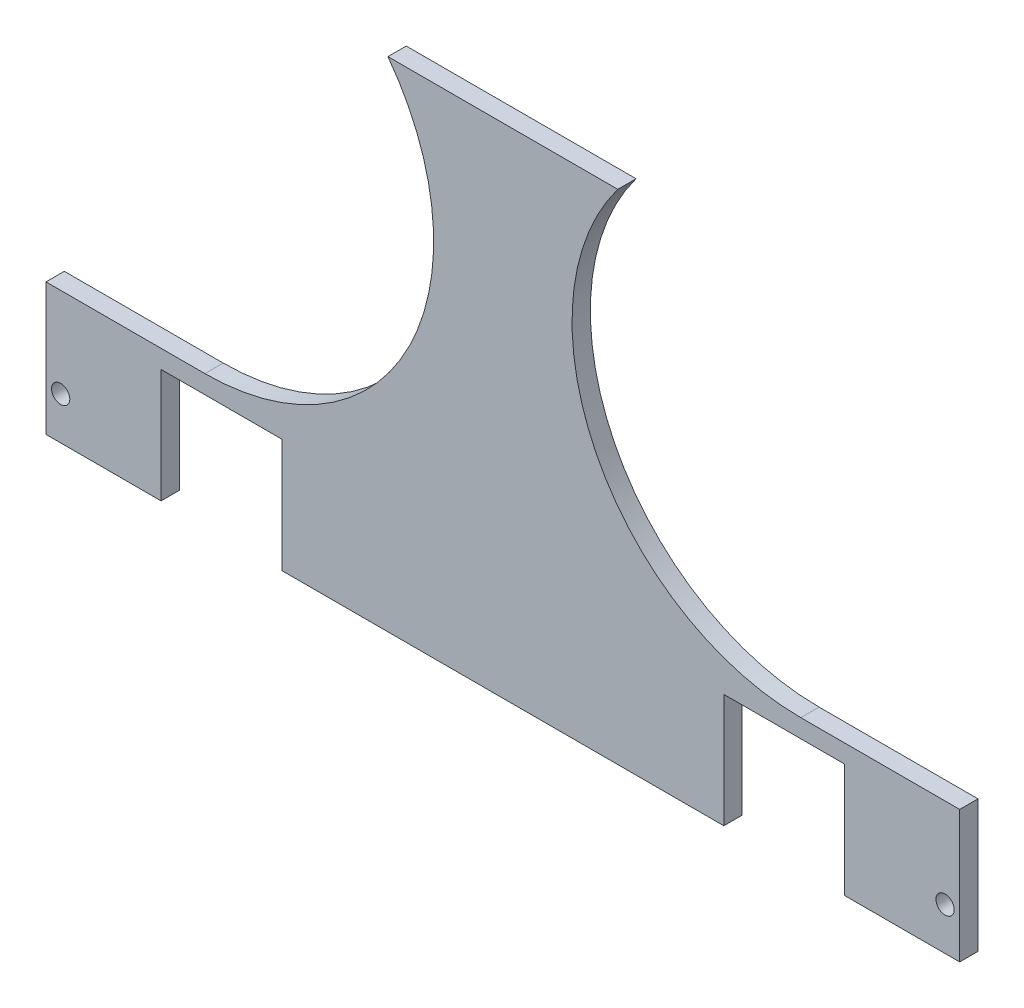
ISO-10303-21;
HEADER;
FILE_DESCRIPTION(('STEP AP214'),'2;1');
FILE_NAME('part.step','',(''),(''),'','','');
FILE_SCHEMA(('AUTOMOTIVE_DESIGN { 1 0 10303 214 1 1 1 1 }'));
ENDSEC;
DATA;
#1=APPLICATION_CONTEXT('core data for automotive mechanical design processes');
#2=APPLICATION_PROTOCOL_DEFINITION('international standard','automotive_design',2000,#1);
#3=PRODUCT_CONTEXT('',#1,'mechanical');
#4=PRODUCT('Part','Part','',(#3));
#5=PRODUCT_RELATED_PRODUCT_CATEGORY('part','',(#4));
#6=PRODUCT_DEFINITION_FORMATION('','',#4);
#7=PRODUCT_DEFINITION_CONTEXT('part definition',#1,'design');
#8=PRODUCT_DEFINITION('design','',#6,#7);
#9=PRODUCT_DEFINITION_SHAPE('','',#8);
#10=(LENGTH_UNIT() NAMED_UNIT(*) SI_UNIT(.MILLI.,.METRE.));
#11=(NAMED_UNIT(*) PLANE_ANGLE_UNIT() SI_UNIT($,.RADIAN.));
#12=(NAMED_UNIT(*) SI_UNIT($,.STERADIAN.) SOLID_ANGLE_UNIT());
#13=UNCERTAINTY_MEASURE_WITH_UNIT(LENGTH_MEASURE(1.E-05),#10,'distance_accuracy_value','');
#14=(GEOMETRIC_REPRESENTATION_CONTEXT(3) GLOBAL_UNCERTAINTY_ASSIGNED_CONTEXT((#13)) GLOBAL_UNIT_ASSIGNED_CONTEXT((#10,
#11,#12)) REPRESENTATION_CONTEXT('',''));
#15=CARTESIAN_POINT('',(0.,0.,0.));
#16=DIRECTION('',(0.,0.,1.));
#17=DIRECTION('',(1.,0.,0.));
#18=AXIS2_PLACEMENT_3D('',#15,#16,#17);
#19=CARTESIAN_POINT('',(0.,0.,5.));
#20=DIRECTION('',(0.,0.,1.));
#21=DIRECTION('',(1.,0.,0.));
#22=AXIS2_PLACEMENT_3D('',#19,#20,#21);
#23=PLANE('',#22);
#24=DIRECTION('',(-1.,0.,0.));
#25=VECTOR('',#24,1.);
#26=CARTESIAN_POINT('',(0.,-205.095411396092,5.));
#27=LINE('',#26,#25);
#28=CARTESIAN_POINT('',(249.600000000001,-205.095411396092,5.));
#29=VERTEX_POINT('',#28);
#30=CARTESIAN_POINT('',(218.160000000001,-205.095411396092,5.));
#31=VERTEX_POINT('',#30);
#32=EDGE_CURVE('E288',#29,#31,#27,.T.);
#33=ORIENTED_EDGE('',*,*,#32,.F.);
#34=DIRECTION('',(0.,1.,0.));
#35=VECTOR('',#34,1.);
#36=CARTESIAN_POINT('',(249.600000000001,-69.0000000000026,5.));
#37=LINE('',#36,#35);
#38=CARTESIAN_POINT('',(249.600000000001,-169.000000000002,5.));
#39=VERTEX_POINT('',#38);
#40=EDGE_CURVE('E164',#29,#39,#37,.T.);
#41=ORIENTED_EDGE('',*,*,#40,.T.);
#42=DIRECTION('',(1.,0.,0.));
#43=VECTOR('',#42,1.);
#44=CARTESIAN_POINT('',(206.197139998898,-169.000000000002,5.));
#45=LINE('',#44,#43);
#46=CARTESIAN_POINT('',(206.197139998898,-169.000000000002,5.));
#47=VERTEX_POINT('',#46);
#48=EDGE_CURVE('E211',#47,#39,#45,.T.);
#49=ORIENTED_EDGE('',*,*,#48,.F.);
#50=CARTESIAN_POINT('',(206.197139998898,-106.500000000002,5.));
#51=DIRECTION('',(0.,0.,1.));
#52=DIRECTION('',(1.,0.,0.));
#53=AXIS2_PLACEMENT_3D('',#50,#51,#52);
#54=CIRCLE('',#53,62.5);
#55=CARTESIAN_POINT('',(156.197139998898,-69.0000000000026,5.));
#56=VERTEX_POINT('',#55);
#57=EDGE_CURVE('E214',#56,#47,#54,.T.);
#58=ORIENTED_EDGE('',*,*,#57,.F.);
#59=DIRECTION('',(-1.,0.,0.));
#60=VECTOR('',#59,1.);
#61=CARTESIAN_POINT('',(8.39606162372775E-13,-69.0000000000026,5.));
#62=LINE('',#61,#60);
#63=CARTESIAN_POINT('',(93.4028600011043,-69.0000000000026,5.));
#64=VERTEX_POINT('',#63);
#65=EDGE_CURVE('E183',#56,#64,#62,.T.);
#66=ORIENTED_EDGE('',*,*,#65,.T.);
#67=CARTESIAN_POINT('',(43.4028600011041,-106.500000000002,5.));
#68=DIRECTION('',(0.,0.,1.));
#69=DIRECTION('',(1.,0.,0.));
#70=AXIS2_PLACEMENT_3D('',#67,#68,#69);
#71=CIRCLE('',#70,62.5);
#72=CARTESIAN_POINT('',(43.4028600011041,-169.000000000002,5.));
#73=VERTEX_POINT('',#72);
#74=EDGE_CURVE('E48',#73,#64,#71,.T.);
#75=ORIENTED_EDGE('',*,*,#74,.F.);
#76=DIRECTION('',(1.,0.,0.));
#77=VECTOR('',#76,1.);
#78=CARTESIAN_POINT('',(43.4028600011041,-169.000000000002,5.));
#79=LINE('',#78,#77);
#80=CARTESIAN_POINT('',(9.43689570931383E-13,-169.000000000002,5.));
#81=VERTEX_POINT('',#80);
#82=EDGE_CURVE('E196',#81,#73,#79,.T.);
#83=ORIENTED_EDGE('',*,*,#82,.F.);
#84=DIRECTION('',(0.,-1.,0.));
#85=VECTOR('',#84,1.);
#86=CARTESIAN_POINT('',(8.39606162372775E-13,-69.0000000000026,5.));
#87=LINE('',#86,#85);
#88=CARTESIAN_POINT('',(0.,-205.095411396092,5.));
#89=VERTEX_POINT('',#88);
#90=EDGE_CURVE('E175',#81,#89,#87,.T.);
#91=ORIENTED_EDGE('',*,*,#90,.T.);
#92=CARTESIAN_POINT('',(31.440000000001,-205.095411396092,5.));
#93=VERTEX_POINT('',#92);
#94=EDGE_CURVE('E208',#93,#89,#27,.T.);
#95=ORIENTED_EDGE('',*,*,#94,.F.);
#96=DIRECTION('',(0.,-1.,0.));
#97=VECTOR('',#96,1.);
#98=CARTESIAN_POINT('',(31.440000000001,-174.000000000003,5.));
#99=LINE('',#98,#97);
#100=CARTESIAN_POINT('',(31.440000000001,-174.000000000003,5.));
#101=VERTEX_POINT('',#100);
#102=EDGE_CURVE('E228',#101,#93,#99,.T.);
#103=ORIENTED_EDGE('',*,*,#102,.F.);
#104=DIRECTION('',(-1.,0.,0.));
#105=VECTOR('',#104,1.);
#106=CARTESIAN_POINT('',(64.4400000000009,-174.000000000003,5.));
#107=LINE('',#106,#105);
#108=CARTESIAN_POINT('',(64.4400000000009,-174.000000000003,5.));
#109=VERTEX_POINT('',#108);
#110=EDGE_CURVE('E226',#109,#101,#107,.T.);
#111=ORIENTED_EDGE('',*,*,#110,.F.);
#112=DIRECTION('',(0.,1.,0.));
#113=VECTOR('',#112,1.);
#114=CARTESIAN_POINT('',(64.4400000000009,-174.000000000003,5.));
#115=LINE('',#114,#113);
#116=CARTESIAN_POINT('',(64.4400000000009,-205.095411396092,5.));
#117=VERTEX_POINT('',#116);
#118=EDGE_CURVE('E232',#117,#109,#115,.T.);
#119=ORIENTED_EDGE('',*,*,#118,.F.);
#120=CARTESIAN_POINT('',(185.160000000001,-205.095411396092,5.));
#121=VERTEX_POINT('',#120);
#122=EDGE_CURVE('E290',#121,#117,#27,.T.);
#123=ORIENTED_EDGE('',*,*,#122,.F.);
#124=DIRECTION('',(0.,-1.,0.));
#125=VECTOR('',#124,1.);
#126=CARTESIAN_POINT('',(185.160000000001,-174.000000000003,5.));
#127=LINE('',#126,#125);
#128=CARTESIAN_POINT('',(185.160000000001,-174.000000000003,5.));
#129=VERTEX_POINT('',#128);
#130=EDGE_CURVE('E259',#129,#121,#127,.T.);
#131=ORIENTED_EDGE('',*,*,#130,.F.);
#132=DIRECTION('',(-1.,0.,0.));
#133=VECTOR('',#132,1.);
#134=CARTESIAN_POINT('',(185.160000000001,-174.000000000003,5.));
#135=LINE('',#134,#133);
#136=CARTESIAN_POINT('',(218.160000000001,-174.000000000003,5.));
#137=VERTEX_POINT('',#136);
#138=EDGE_CURVE('E265',#137,#129,#135,.T.);
#139=ORIENTED_EDGE('',*,*,#138,.F.);
#140=DIRECTION('',(0.,1.,0.));
#141=VECTOR('',#140,1.);
#142=CARTESIAN_POINT('',(218.160000000001,-174.000000000003,5.));
#143=LINE('',#142,#141);
#144=EDGE_CURVE('E262',#31,#137,#143,.T.);
#145=ORIENTED_EDGE('',*,*,#144,.F.);
#146=EDGE_LOOP('',(#33,#41,#49,#58,#66,#75,#83,#91,#95,#103,#111,#119,#123,#131,#139,#145));
#147=FACE_BOUND('',#146,.T.);
#148=CARTESIAN_POINT('',(245.600000000001,-193.500000000003,5.));
#149=DIRECTION('',(0.,0.,1.));
#150=DIRECTION('',(1.,0.,0.));
#151=AXIS2_PLACEMENT_3D('',#148,#149,#150);
#152=CIRCLE('',#151,2.50000000000002);
#153=CARTESIAN_POINT('',(248.100000000001,-193.500000000003,5.));
#154=VERTEX_POINT('',#153);
#155=EDGE_CURVE('E253',#154,#154,#152,.T.);
#156=ORIENTED_EDGE('',*,*,#155,.F.);
#157=EDGE_LOOP('',(#156));
#158=FACE_BOUND('',#157,.T.);
#159=CARTESIAN_POINT('',(4.00000000000093,-193.500000000003,5.));
#160=DIRECTION('',(0.,0.,1.));
#161=DIRECTION('',(-1.,0.,0.));
#162=AXIS2_PLACEMENT_3D('',#159,#160,#161);
#163=CIRCLE('',#162,2.50000000000002);
#164=CARTESIAN_POINT('',(1.50000000000091,-193.500000000003,5.));
#165=VERTEX_POINT('',#164);
#166=EDGE_CURVE('E247',#165,#165,#163,.T.);
#167=ORIENTED_EDGE('',*,*,#166,.F.);
#168=EDGE_LOOP('',(#167));
#169=FACE_BOUND('',#168,.T.);
#170=ADVANCED_FACE('F33',(#147,#158,#169),#23,.T.);
#171=CARTESIAN_POINT('',(0.,0.,0.));
#172=DIRECTION('',(0.,0.,1.));
#173=DIRECTION('',(1.,0.,0.));
#174=AXIS2_PLACEMENT_3D('',#171,#172,#173);
#175=PLANE('',#174);
#176=CARTESIAN_POINT('',(4.00000000000093,-193.500000000003,0.));
#177=DIRECTION('',(0.,0.,1.));
#178=DIRECTION('',(-1.,0.,0.));
#179=AXIS2_PLACEMENT_3D('',#176,#177,#178);
#180=CIRCLE('',#179,2.50000000000002);
#181=CARTESIAN_POINT('',(1.50000000000091,-193.500000000003,0.));
#182=VERTEX_POINT('',#181);
#183=EDGE_CURVE('E246',#182,#182,#180,.T.);
#184=ORIENTED_EDGE('',*,*,#183,.T.);
#185=EDGE_LOOP('',(#184));
#186=FACE_BOUND('',#185,.T.);
#187=CARTESIAN_POINT('',(245.600000000001,-193.500000000003,0.));
#188=DIRECTION('',(0.,0.,1.));
#189=DIRECTION('',(1.,0.,0.));
#190=AXIS2_PLACEMENT_3D('',#187,#188,#189);
#191=CIRCLE('',#190,2.50000000000002);
#192=CARTESIAN_POINT('',(248.100000000001,-193.500000000003,0.));
#193=VERTEX_POINT('',#192);
#194=EDGE_CURVE('E250',#193,#193,#191,.T.);
#195=ORIENTED_EDGE('',*,*,#194,.T.);
#196=EDGE_LOOP('',(#195));
#197=FACE_BOUND('',#196,.T.);
#198=DIRECTION('',(0.,1.,0.));
#199=VECTOR('',#198,1.);
#200=CARTESIAN_POINT('',(249.600000000001,-69.0000000000026,0.));
#201=LINE('',#200,#199);
#202=CARTESIAN_POINT('',(249.600000000001,-205.095411396092,0.));
#203=VERTEX_POINT('',#202);
#204=CARTESIAN_POINT('',(249.600000000001,-169.000000000002,0.));
#205=VERTEX_POINT('',#204);
#206=EDGE_CURVE('E162',#203,#205,#201,.T.);
#207=ORIENTED_EDGE('',*,*,#206,.F.);
#208=DIRECTION('',(-1.,0.,0.));
#209=VECTOR('',#208,1.);
#210=CARTESIAN_POINT('',(0.,-205.095411396092,0.));
#211=LINE('',#210,#209);
#212=CARTESIAN_POINT('',(218.160000000001,-205.095411396092,0.));
#213=VERTEX_POINT('',#212);
#214=EDGE_CURVE('E144',#203,#213,#211,.T.);
#215=ORIENTED_EDGE('',*,*,#214,.T.);
#216=DIRECTION('',(0.,1.,0.));
#217=VECTOR('',#216,1.);
#218=CARTESIAN_POINT('',(218.160000000001,-174.000000000003,0.));
#219=LINE('',#218,#217);
#220=CARTESIAN_POINT('',(218.160000000001,-174.000000000003,0.));
#221=VERTEX_POINT('',#220);
#222=EDGE_CURVE('E270',#213,#221,#219,.T.);
#223=ORIENTED_EDGE('',*,*,#222,.T.);
#224=DIRECTION('',(-1.,0.,0.));
#225=VECTOR('',#224,1.);
#226=CARTESIAN_POINT('',(185.160000000001,-174.000000000003,0.));
#227=LINE('',#226,#225);
#228=CARTESIAN_POINT('',(185.160000000001,-174.000000000003,0.));
#229=VERTEX_POINT('',#228);
#230=EDGE_CURVE('E263',#221,#229,#227,.T.);
#231=ORIENTED_EDGE('',*,*,#230,.T.);
#232=DIRECTION('',(0.,-1.,0.));
#233=VECTOR('',#232,1.);
#234=CARTESIAN_POINT('',(185.160000000001,-174.000000000003,0.));
#235=LINE('',#234,#233);
#236=CARTESIAN_POINT('',(185.160000000001,-205.095411396092,0.));
#237=VERTEX_POINT('',#236);
#238=EDGE_CURVE('E256',#229,#237,#235,.T.);
#239=ORIENTED_EDGE('',*,*,#238,.T.);
#240=CARTESIAN_POINT('',(64.4400000000009,-205.095411396092,0.));
#241=VERTEX_POINT('',#240);
#242=EDGE_CURVE('E154',#237,#241,#211,.T.);
#243=ORIENTED_EDGE('',*,*,#242,.T.);
#244=DIRECTION('',(0.,1.,0.));
#245=VECTOR('',#244,1.);
#246=CARTESIAN_POINT('',(64.4400000000009,-174.000000000003,0.));
#247=LINE('',#246,#245);
#248=CARTESIAN_POINT('',(64.4400000000009,-174.000000000003,0.));
#249=VERTEX_POINT('',#248);
#250=EDGE_CURVE('E229',#241,#249,#247,.T.);
#251=ORIENTED_EDGE('',*,*,#250,.T.);
#252=DIRECTION('',(-1.,0.,0.));
#253=VECTOR('',#252,1.);
#254=CARTESIAN_POINT('',(64.4400000000009,-174.000000000003,0.));
#255=LINE('',#254,#253);
#256=CARTESIAN_POINT('',(31.440000000001,-174.000000000003,0.));
#257=VERTEX_POINT('',#256);
#258=EDGE_CURVE('E225',#249,#257,#255,.T.);
#259=ORIENTED_EDGE('',*,*,#258,.T.);
#260=DIRECTION('',(0.,-1.,0.));
#261=VECTOR('',#260,1.);
#262=CARTESIAN_POINT('',(31.440000000001,-174.000000000003,0.));
#263=LINE('',#262,#261);
#264=CARTESIAN_POINT('',(31.440000000001,-205.095411396092,0.));
#265=VERTEX_POINT('',#264);
#266=EDGE_CURVE('E237',#257,#265,#263,.T.);
#267=ORIENTED_EDGE('',*,*,#266,.T.);
#268=CARTESIAN_POINT('',(0.,-205.095411396092,0.));
#269=VERTEX_POINT('',#268);
#270=EDGE_CURVE('E156',#265,#269,#211,.T.);
#271=ORIENTED_EDGE('',*,*,#270,.T.);
#272=DIRECTION('',(0.,-1.,0.));
#273=VECTOR('',#272,1.);
#274=CARTESIAN_POINT('',(8.39606162372775E-13,-69.0000000000026,0.));
#275=LINE('',#274,#273);
#276=CARTESIAN_POINT('',(9.43689570931383E-13,-169.000000000002,0.));
#277=VERTEX_POINT('',#276);
#278=EDGE_CURVE('E172',#277,#269,#275,.T.);
#279=ORIENTED_EDGE('',*,*,#278,.F.);
#280=DIRECTION('',(1.,0.,0.));
#281=VECTOR('',#280,1.);
#282=CARTESIAN_POINT('',(43.4028600011041,-169.000000000002,0.));
#283=LINE('',#282,#281);
#284=CARTESIAN_POINT('',(43.4028600011041,-169.000000000002,0.));
#285=VERTEX_POINT('',#284);
#286=EDGE_CURVE('E195',#277,#285,#283,.T.);
#287=ORIENTED_EDGE('',*,*,#286,.T.);
#288=CARTESIAN_POINT('',(43.4028600011041,-106.500000000002,0.));
#289=DIRECTION('',(0.,0.,1.));
#290=DIRECTION('',(1.,0.,0.));
#291=AXIS2_PLACEMENT_3D('',#288,#289,#290);
#292=CIRCLE('',#291,62.5);
#293=CARTESIAN_POINT('',(93.4028600011043,-69.0000000000026,0.));
#294=VERTEX_POINT('',#293);
#295=EDGE_CURVE('E193',#285,#294,#292,.T.);
#296=ORIENTED_EDGE('',*,*,#295,.T.);
#297=DIRECTION('',(-1.,0.,0.));
#298=VECTOR('',#297,1.);
#299=CARTESIAN_POINT('',(8.39606162372775E-13,-69.0000000000026,0.));
#300=LINE('',#299,#298);
#301=CARTESIAN_POINT('',(156.197139998898,-69.0000000000026,0.));
#302=VERTEX_POINT('',#301);
#303=EDGE_CURVE('E171',#302,#294,#300,.T.);
#304=ORIENTED_EDGE('',*,*,#303,.F.);
#305=CARTESIAN_POINT('',(206.197139998898,-106.500000000002,0.));
#306=DIRECTION('',(0.,0.,1.));
#307=DIRECTION('',(1.,0.,0.));
#308=AXIS2_PLACEMENT_3D('',#305,#306,#307);
#309=CIRCLE('',#308,62.5);
#310=CARTESIAN_POINT('',(206.197139998898,-169.000000000002,0.));
#311=VERTEX_POINT('',#310);
#312=EDGE_CURVE('E55',#302,#311,#309,.T.);
#313=ORIENTED_EDGE('',*,*,#312,.T.);
#314=DIRECTION('',(1.,0.,0.));
#315=VECTOR('',#314,1.);
#316=CARTESIAN_POINT('',(206.197139998898,-169.000000000002,0.));
#317=LINE('',#316,#315);
#318=EDGE_CURVE('E170',#311,#205,#317,.T.);
#319=ORIENTED_EDGE('',*,*,#318,.T.);
#320=EDGE_LOOP('',(#207,#215,#223,#231,#239,#243,#251,#259,#267,#271,#279,#287,#296,#304,#313,#319));
#321=FACE_BOUND('',#320,.T.);
#322=ADVANCED_FACE('F168',(#186,#197,#321),#175,.F.);
#323=CARTESIAN_POINT('',(8.39606162372775E-13,-69.0000000000026,5.));
#324=DIRECTION('',(1.,0.,0.));
#325=DIRECTION('',(0.,1.,0.));
#326=AXIS2_PLACEMENT_3D('',#323,#324,#325);
#327=PLANE('',#326);
#328=ORIENTED_EDGE('',*,*,#278,.T.);
#329=DIRECTION('',(0.,0.,1.));
#330=VECTOR('',#329,1.);
#331=CARTESIAN_POINT('',(0.,-205.095411396092,0.));
#332=LINE('',#331,#330);
#333=EDGE_CURVE('E165',#269,#89,#332,.T.);
#334=ORIENTED_EDGE('',*,*,#333,.T.);
#335=ORIENTED_EDGE('',*,*,#90,.F.);
#336=DIRECTION('',(0.,0.,1.));
#337=VECTOR('',#336,1.);
#338=CARTESIAN_POINT('',(9.43689570931383E-13,-169.000000000002,0.));
#339=LINE('',#338,#337);
#340=EDGE_CURVE('E198',#277,#81,#339,.T.);
#341=ORIENTED_EDGE('',*,*,#340,.F.);
#342=EDGE_LOOP('',(#328,#334,#335,#341));
#343=FACE_BOUND('',#342,.T.);
#344=ADVANCED_FACE('F35',(#343),#327,.F.);
#345=CARTESIAN_POINT('',(249.600000000001,-69.0000000000026,5.));
#346=DIRECTION('',(-1.,0.,0.));
#347=DIRECTION('',(0.,-1.,0.));
#348=AXIS2_PLACEMENT_3D('',#345,#346,#347);
#349=PLANE('',#348);
#350=ORIENTED_EDGE('',*,*,#40,.F.);
#351=DIRECTION('',(0.,0.,1.));
#352=VECTOR('',#351,1.);
#353=CARTESIAN_POINT('',(249.600000000001,-205.095411396092,0.));
#354=LINE('',#353,#352);
#355=EDGE_CURVE('E147',#203,#29,#354,.T.);
#356=ORIENTED_EDGE('',*,*,#355,.F.);
#357=ORIENTED_EDGE('',*,*,#206,.T.);
#358=DIRECTION('',(0.,0.,1.));
#359=VECTOR('',#358,1.);
#360=CARTESIAN_POINT('',(249.600000000001,-169.000000000002,0.));
#361=LINE('',#360,#359);
#362=EDGE_CURVE('E204',#205,#39,#361,.T.);
#363=ORIENTED_EDGE('',*,*,#362,.T.);
#364=EDGE_LOOP('',(#350,#356,#357,#363));
#365=FACE_BOUND('',#364,.T.);
#366=ADVANCED_FACE('F160',(#365),#349,.F.);
#367=CARTESIAN_POINT('',(8.39606162372775E-13,-69.0000000000026,5.));
#368=DIRECTION('',(0.,-1.,0.));
#369=DIRECTION('',(1.,0.,0.));
#370=AXIS2_PLACEMENT_3D('',#367,#368,#369);
#371=PLANE('',#370);
#372=ORIENTED_EDGE('',*,*,#303,.T.);
#373=DIRECTION('',(0.,0.,1.));
#374=VECTOR('',#373,1.);
#375=CARTESIAN_POINT('',(93.4028600011043,-69.0000000000026,0.));
#376=LINE('',#375,#374);
#377=EDGE_CURVE('E11',#294,#64,#376,.T.);
#378=ORIENTED_EDGE('',*,*,#377,.T.);
#379=ORIENTED_EDGE('',*,*,#65,.F.);
#380=DIRECTION('',(0.,0.,1.));
#381=VECTOR('',#380,1.);
#382=CARTESIAN_POINT('',(156.197139998898,-69.0000000000026,0.));
#383=LINE('',#382,#381);
#384=EDGE_CURVE('E41',#56,#302,#383,.F.);
#385=ORIENTED_EDGE('',*,*,#384,.T.);
#386=EDGE_LOOP('',(#372,#378,#379,#385));
#387=FACE_BOUND('',#386,.T.);
#388=ADVANCED_FACE('F187',(#387),#371,.F.);
#389=CARTESIAN_POINT('',(185.160000000001,-174.000000000003,5.));
#390=DIRECTION('',(1.,0.,0.));
#391=DIRECTION('',(0.,0.,-1.));
#392=AXIS2_PLACEMENT_3D('',#389,#390,#391);
#393=PLANE('',#392);
#394=DIRECTION('',(0.,0.,1.));
#395=VECTOR('',#394,1.);
#396=CARTESIAN_POINT('',(185.160000000001,-205.095411396092,5.));
#397=LINE('',#396,#395);
#398=EDGE_CURVE('E223',#237,#121,#397,.T.);
#399=ORIENTED_EDGE('',*,*,#398,.F.);
#400=ORIENTED_EDGE('',*,*,#238,.F.);
#401=DIRECTION('',(0.,0.,-1.));
#402=VECTOR('',#401,1.);
#403=CARTESIAN_POINT('',(185.160000000001,-174.000000000003,5.));
#404=LINE('',#403,#402);
#405=EDGE_CURVE('E267',#129,#229,#404,.T.);
#406=ORIENTED_EDGE('',*,*,#405,.F.);
#407=ORIENTED_EDGE('',*,*,#130,.T.);
#408=EDGE_LOOP('',(#399,#400,#406,#407));
#409=FACE_BOUND('',#408,.T.);
#410=ADVANCED_FACE('F325',(#409),#393,.T.);
#411=CARTESIAN_POINT('',(218.160000000001,-174.000000000003,5.));
#412=DIRECTION('',(-1.,0.,0.));
#413=DIRECTION('',(0.,-1.,0.));
#414=AXIS2_PLACEMENT_3D('',#411,#412,#413);
#415=PLANE('',#414);
#416=DIRECTION('',(0.,0.,-1.));
#417=VECTOR('',#416,1.);
#418=CARTESIAN_POINT('',(218.160000000001,-205.095411396092,5.));
#419=LINE('',#418,#417);
#420=EDGE_CURVE('E150',#31,#213,#419,.T.);
#421=ORIENTED_EDGE('',*,*,#420,.F.);
#422=ORIENTED_EDGE('',*,*,#144,.T.);
#423=DIRECTION('',(0.,0.,-1.));
#424=VECTOR('',#423,1.);
#425=CARTESIAN_POINT('',(218.160000000001,-174.000000000003,5.));
#426=LINE('',#425,#424);
#427=EDGE_CURVE('E178',#137,#221,#426,.T.);
#428=ORIENTED_EDGE('',*,*,#427,.T.);
#429=ORIENTED_EDGE('',*,*,#222,.F.);
#430=EDGE_LOOP('',(#421,#422,#428,#429));
#431=FACE_BOUND('',#430,.T.);
#432=ADVANCED_FACE('F331',(#431),#415,.T.);
#433=CARTESIAN_POINT('',(185.160000000001,-174.000000000003,5.));
#434=DIRECTION('',(0.,-1.,0.));
#435=DIRECTION('',(1.,0.,0.));
#436=AXIS2_PLACEMENT_3D('',#433,#434,#435);
#437=PLANE('',#436);
#438=ORIENTED_EDGE('',*,*,#230,.F.);
#439=ORIENTED_EDGE('',*,*,#427,.F.);
#440=ORIENTED_EDGE('',*,*,#138,.T.);
#441=ORIENTED_EDGE('',*,*,#405,.T.);
#442=EDGE_LOOP('',(#438,#439,#440,#441));
#443=FACE_BOUND('',#442,.T.);
#444=ADVANCED_FACE('F328',(#443),#437,.T.);
#445=CARTESIAN_POINT('',(245.600000000001,-193.500000000003,5.));
#446=DIRECTION('',(0.,0.,-1.));
#447=DIRECTION('',(-1.,0.,0.));
#448=AXIS2_PLACEMENT_3D('',#445,#446,#447);
#449=CYLINDRICAL_SURFACE('',#448,2.50000000000002);
#450=ORIENTED_EDGE('',*,*,#155,.T.);
#451=EDGE_LOOP('',(#450));
#452=FACE_BOUND('',#451,.T.);
#453=ORIENTED_EDGE('',*,*,#194,.F.);
#454=EDGE_LOOP('',(#453));
#455=FACE_BOUND('',#454,.T.);
#456=ADVANCED_FACE('F338',(#452,#455),#449,.F.);
#457=CARTESIAN_POINT('',(4.00000000000093,-193.500000000003,5.));
#458=DIRECTION('',(0.,0.,-1.));
#459=DIRECTION('',(-1.,0.,0.));
#460=AXIS2_PLACEMENT_3D('',#457,#458,#459);
#461=CYLINDRICAL_SURFACE('',#460,2.50000000000002);
#462=ORIENTED_EDGE('',*,*,#166,.T.);
#463=EDGE_LOOP('',(#462));
#464=FACE_BOUND('',#463,.T.);
#465=ORIENTED_EDGE('',*,*,#183,.F.);
#466=EDGE_LOOP('',(#465));
#467=FACE_BOUND('',#466,.T.);
#468=ADVANCED_FACE('F373',(#464,#467),#461,.F.);
#469=CARTESIAN_POINT('',(64.4400000000009,-174.000000000003,5.));
#470=DIRECTION('',(0.,-1.,0.));
#471=DIRECTION('',(1.,0.,0.));
#472=AXIS2_PLACEMENT_3D('',#469,#470,#471);
#473=PLANE('',#472);
#474=ORIENTED_EDGE('',*,*,#258,.F.);
#475=DIRECTION('',(0.,0.,-1.));
#476=VECTOR('',#475,1.);
#477=CARTESIAN_POINT('',(64.4400000000009,-174.000000000003,5.));
#478=LINE('',#477,#476);
#479=EDGE_CURVE('E234',#109,#249,#478,.T.);
#480=ORIENTED_EDGE('',*,*,#479,.F.);
#481=ORIENTED_EDGE('',*,*,#110,.T.);
#482=DIRECTION('',(0.,0.,-1.));
#483=VECTOR('',#482,1.);
#484=CARTESIAN_POINT('',(31.440000000001,-174.000000000003,5.));
#485=LINE('',#484,#483);
#486=EDGE_CURVE('E243',#101,#257,#485,.T.);
#487=ORIENTED_EDGE('',*,*,#486,.T.);
#488=EDGE_LOOP('',(#474,#480,#481,#487));
#489=FACE_BOUND('',#488,.T.);
#490=ADVANCED_FACE('F313',(#489),#473,.T.);
#491=CARTESIAN_POINT('',(31.440000000001,-174.000000000003,5.));
#492=DIRECTION('',(1.,0.,0.));
#493=DIRECTION('',(0.,0.,-1.));
#494=AXIS2_PLACEMENT_3D('',#491,#492,#493);
#495=PLANE('',#494);
#496=DIRECTION('',(0.,0.,1.));
#497=VECTOR('',#496,1.);
#498=CARTESIAN_POINT('',(31.440000000001,-205.095411396092,5.));
#499=LINE('',#498,#497);
#500=EDGE_CURVE('E220',#265,#93,#499,.T.);
#501=ORIENTED_EDGE('',*,*,#500,.F.);
#502=ORIENTED_EDGE('',*,*,#266,.F.);
#503=ORIENTED_EDGE('',*,*,#486,.F.);
#504=ORIENTED_EDGE('',*,*,#102,.T.);
#505=EDGE_LOOP('',(#501,#502,#503,#504));
#506=FACE_BOUND('',#505,.T.);
#507=ADVANCED_FACE('F305',(#506),#495,.T.);
#508=CARTESIAN_POINT('',(64.4400000000009,-174.000000000003,5.));
#509=DIRECTION('',(-1.,0.,0.));
#510=DIRECTION('',(0.,0.,1.));
#511=AXIS2_PLACEMENT_3D('',#508,#509,#510);
#512=PLANE('',#511);
#513=DIRECTION('',(0.,0.,-1.));
#514=VECTOR('',#513,1.);
#515=CARTESIAN_POINT('',(64.4400000000009,-205.095411396092,5.));
#516=LINE('',#515,#514);
#517=EDGE_CURVE('E182',#117,#241,#516,.T.);
#518=ORIENTED_EDGE('',*,*,#517,.F.);
#519=ORIENTED_EDGE('',*,*,#118,.T.);
#520=ORIENTED_EDGE('',*,*,#479,.T.);
#521=ORIENTED_EDGE('',*,*,#250,.F.);
#522=EDGE_LOOP('',(#518,#519,#520,#521));
#523=FACE_BOUND('',#522,.T.);
#524=ADVANCED_FACE('F317',(#523),#512,.T.);
#525=CARTESIAN_POINT('',(0.,-205.095411396092,0.));
#526=DIRECTION('',(0.,1.,0.));
#527=DIRECTION('',(0.,0.,1.));
#528=AXIS2_PLACEMENT_3D('',#525,#526,#527);
#529=PLANE('',#528);
#530=ORIENTED_EDGE('',*,*,#398,.T.);
#531=ORIENTED_EDGE('',*,*,#122,.T.);
#532=ORIENTED_EDGE('',*,*,#517,.T.);
#533=ORIENTED_EDGE('',*,*,#242,.F.);
#534=EDGE_LOOP('',(#530,#531,#532,#533));
#535=FACE_BOUND('',#534,.T.);
#536=ADVANCED_FACE('F320',(#535),#529,.F.);
#537=ORIENTED_EDGE('',*,*,#500,.T.);
#538=ORIENTED_EDGE('',*,*,#94,.T.);
#539=ORIENTED_EDGE('',*,*,#333,.F.);
#540=ORIENTED_EDGE('',*,*,#270,.F.);
#541=EDGE_LOOP('',(#537,#538,#539,#540));
#542=FACE_BOUND('',#541,.T.);
#543=ADVANCED_FACE('F296',(#542),#529,.F.);
#544=ORIENTED_EDGE('',*,*,#420,.T.);
#545=ORIENTED_EDGE('',*,*,#214,.F.);
#546=ORIENTED_EDGE('',*,*,#355,.T.);
#547=ORIENTED_EDGE('',*,*,#32,.T.);
#548=EDGE_LOOP('',(#544,#545,#546,#547));
#549=FACE_BOUND('',#548,.T.);
#550=ADVANCED_FACE('F146',(#549),#529,.F.);
#551=CARTESIAN_POINT('',(206.197139998898,-106.500000000002,0.));
#552=DIRECTION('',(0.,0.,1.));
#553=DIRECTION('',(1.,0.,0.));
#554=AXIS2_PLACEMENT_3D('',#551,#552,#553);
#555=CYLINDRICAL_SURFACE('',#554,62.5);
#556=ORIENTED_EDGE('',*,*,#57,.T.);
#557=DIRECTION('',(0.,0.,1.));
#558=VECTOR('',#557,1.);
#559=CARTESIAN_POINT('',(206.197139998898,-169.000000000002,0.));
#560=LINE('',#559,#558);
#561=EDGE_CURVE('E213',#311,#47,#560,.T.);
#562=ORIENTED_EDGE('',*,*,#561,.F.);
#563=ORIENTED_EDGE('',*,*,#312,.F.);
#564=ORIENTED_EDGE('',*,*,#384,.F.);
#565=EDGE_LOOP('',(#556,#562,#563,#564));
#566=FACE_BOUND('',#565,.T.);
#567=ADVANCED_FACE('F284',(#566),#555,.F.);
#568=CARTESIAN_POINT('',(206.197139998898,-169.000000000002,0.));
#569=DIRECTION('',(0.,-1.,0.));
#570=DIRECTION('',(0.,0.,-1.));
#571=AXIS2_PLACEMENT_3D('',#568,#569,#570);
#572=PLANE('',#571);
#573=ORIENTED_EDGE('',*,*,#48,.T.);
#574=ORIENTED_EDGE('',*,*,#362,.F.);
#575=ORIENTED_EDGE('',*,*,#318,.F.);
#576=ORIENTED_EDGE('',*,*,#561,.T.);
#577=EDGE_LOOP('',(#573,#574,#575,#576));
#578=FACE_BOUND('',#577,.T.);
#579=ADVANCED_FACE('F286',(#578),#572,.F.);
#580=CARTESIAN_POINT('',(43.4028600011041,-106.500000000002,0.));
#581=DIRECTION('',(0.,0.,1.));
#582=DIRECTION('',(1.,0.,0.));
#583=AXIS2_PLACEMENT_3D('',#580,#581,#582);
#584=CYLINDRICAL_SURFACE('',#583,62.5);
#585=ORIENTED_EDGE('',*,*,#295,.F.);
#586=DIRECTION('',(0.,0.,1.));
#587=VECTOR('',#586,1.);
#588=CARTESIAN_POINT('',(43.4028600011041,-169.000000000002,0.));
#589=LINE('',#588,#587);
#590=EDGE_CURVE('E206',#285,#73,#589,.T.);
#591=ORIENTED_EDGE('',*,*,#590,.T.);
#592=ORIENTED_EDGE('',*,*,#74,.T.);
#593=ORIENTED_EDGE('',*,*,#377,.F.);
#594=EDGE_LOOP('',(#585,#591,#592,#593));
#595=FACE_BOUND('',#594,.T.);
#596=ADVANCED_FACE('F474',(#595),#584,.F.);
#597=CARTESIAN_POINT('',(43.4028600011041,-169.000000000002,0.));
#598=DIRECTION('',(0.,-1.,0.));
#599=DIRECTION('',(0.,0.,-1.));
#600=AXIS2_PLACEMENT_3D('',#597,#598,#599);
#601=PLANE('',#600);
#602=ORIENTED_EDGE('',*,*,#82,.T.);
#603=ORIENTED_EDGE('',*,*,#590,.F.);
#604=ORIENTED_EDGE('',*,*,#286,.F.);
#605=ORIENTED_EDGE('',*,*,#340,.T.);
#606=EDGE_LOOP('',(#602,#603,#604,#605));
#607=FACE_BOUND('',#606,.T.);
#608=ADVANCED_FACE('F303',(#607),#601,.F.);
#609=CLOSED_SHELL('',(#170,#322,#344,#366,#388,#410,#432,#444,#456,#468,#490,#507,#524,#536,
#543,#550,#567,#579,#596,#608));
#610=MANIFOLD_SOLID_BREP('B2',#609);
#611=ADVANCED_BREP_SHAPE_REPRESENTATION('',(#18,#610),#14);
#612=SHAPE_DEFINITION_REPRESENTATION(#9,#611);
ENDSEC;
END-ISO-10303-21;
